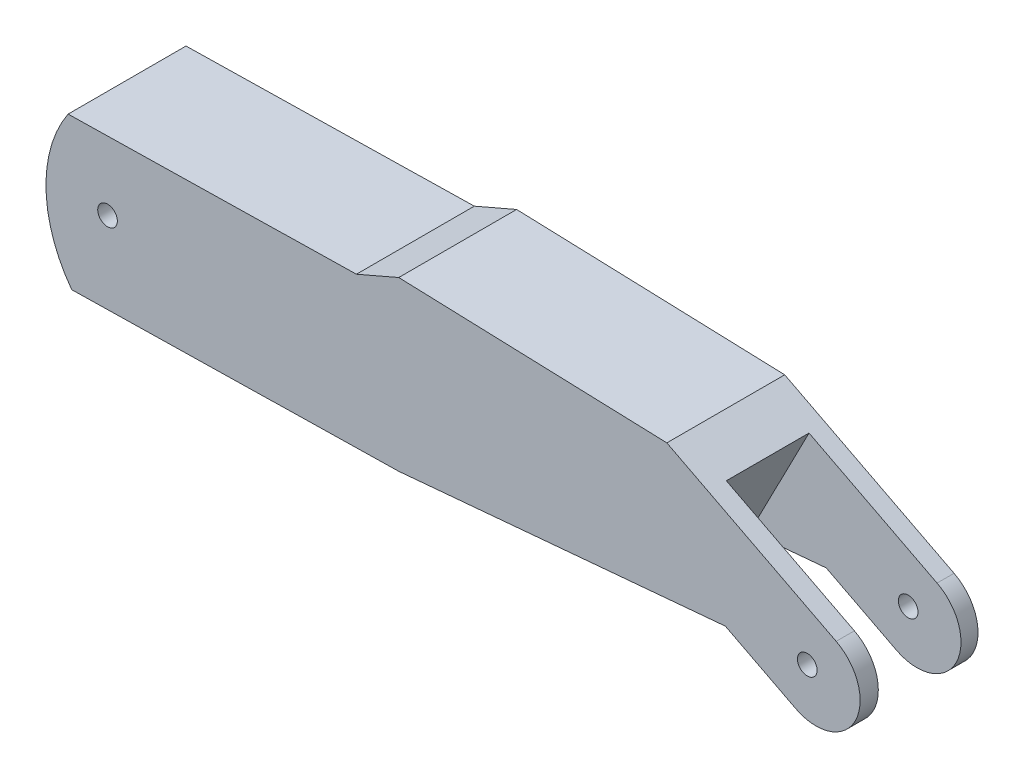
ISO-10303-21;
HEADER;
FILE_DESCRIPTION(('STEP AP214'),'2;1');
FILE_NAME('part.step','',(''),(''),'','','');
FILE_SCHEMA(('AUTOMOTIVE_DESIGN { 1 0 10303 214 1 1 1 1 }'));
ENDSEC;
DATA;
#1=APPLICATION_CONTEXT('core data for automotive mechanical design processes');
#2=APPLICATION_PROTOCOL_DEFINITION('international standard','automotive_design',2000,#1);
#3=PRODUCT_CONTEXT('',#1,'mechanical');
#4=PRODUCT('Part','Part','',(#3));
#5=PRODUCT_RELATED_PRODUCT_CATEGORY('part','',(#4));
#6=PRODUCT_DEFINITION_FORMATION('','',#4);
#7=PRODUCT_DEFINITION_CONTEXT('part definition',#1,'design');
#8=PRODUCT_DEFINITION('design','',#6,#7);
#9=PRODUCT_DEFINITION_SHAPE('','',#8);
#10=(LENGTH_UNIT() NAMED_UNIT(*) SI_UNIT(.MILLI.,.METRE.));
#11=(NAMED_UNIT(*) PLANE_ANGLE_UNIT() SI_UNIT($,.RADIAN.));
#12=(NAMED_UNIT(*) SI_UNIT($,.STERADIAN.) SOLID_ANGLE_UNIT());
#13=UNCERTAINTY_MEASURE_WITH_UNIT(LENGTH_MEASURE(1.E-05),#10,'distance_accuracy_value','');
#14=(GEOMETRIC_REPRESENTATION_CONTEXT(3) GLOBAL_UNCERTAINTY_ASSIGNED_CONTEXT((#13)) GLOBAL_UNIT_ASSIGNED_CONTEXT((#10,
#11,#12)) REPRESENTATION_CONTEXT('',''));
#15=CARTESIAN_POINT('',(0.,0.,0.));
#16=DIRECTION('',(0.,0.,1.));
#17=DIRECTION('',(1.,0.,0.));
#18=AXIS2_PLACEMENT_3D('',#15,#16,#17);
#19=CARTESIAN_POINT('',(113.217328201864,-21.3858026280319,60.));
#20=DIRECTION('',(0.457837785493839,0.889035748535512,0.));
#21=DIRECTION('',(-0.889035748535512,0.457837785493839,0.));
#22=AXIS2_PLACEMENT_3D('',#19,#20,#21);
#23=PLANE('',#22);
#24=DIRECTION('',(0.,0.,-1.));
#25=VECTOR('',#24,1.);
#26=CARTESIAN_POINT('',(149.041351205714,-39.8345448598045,60.));
#27=LINE('',#26,#25);
#28=CARTESIAN_POINT('',(149.041351205714,-39.8345448598045,8.65438853895739));
#29=VERTEX_POINT('',#28);
#30=CARTESIAN_POINT('',(149.041351205714,-39.8345448598045,0.));
#31=VERTEX_POINT('',#30);
#32=EDGE_CURVE('E202',#29,#31,#27,.T.);
#33=ORIENTED_EDGE('',*,*,#32,.F.);
#34=DIRECTION('',(-0.889035748535512,0.457837785493839,0.));
#35=VECTOR('',#34,1.);
#36=CARTESIAN_POINT('',(113.217328201864,-21.3858026280319,8.65438853895738));
#37=LINE('',#36,#35);
#38=CARTESIAN_POINT('',(113.217328201864,-21.3858026280319,8.65438853895738));
#39=VERTEX_POINT('',#38);
#40=EDGE_CURVE('E279',#29,#39,#37,.T.);
#41=ORIENTED_EDGE('',*,*,#40,.T.);
#42=DIRECTION('',(0.,0.,-1.));
#43=VECTOR('',#42,1.);
#44=CARTESIAN_POINT('',(113.217328201864,-21.3858026280319,60.));
#45=LINE('',#44,#43);
#46=CARTESIAN_POINT('',(113.217328201864,-21.3858026280319,0.));
#47=VERTEX_POINT('',#46);
#48=EDGE_CURVE('E207',#39,#47,#45,.T.);
#49=ORIENTED_EDGE('',*,*,#48,.T.);
#50=DIRECTION('',(0.889035748535511,-0.457837785493839,0.));
#51=VECTOR('',#50,1.);
#52=CARTESIAN_POINT('',(113.217328201864,-21.3858026280319,0.));
#53=LINE('',#52,#51);
#54=EDGE_CURVE('E172',#47,#31,#53,.T.);
#55=ORIENTED_EDGE('',*,*,#54,.T.);
#56=EDGE_LOOP('',(#33,#41,#49,#55));
#57=FACE_BOUND('',#56,.T.);
#58=ADVANCED_FACE('F38',(#57),#23,.F.);
#59=CARTESIAN_POINT('',(159.330643876884,-19.8546539428758,60.));
#60=DIRECTION('',(0.,0.,-1.));
#61=DIRECTION('',(-1.,0.,0.));
#62=AXIS2_PLACEMENT_3D('',#59,#60,#61);
#63=CYLINDRICAL_SURFACE('',#62,22.4736642478563);
#64=DIRECTION('',(0.,0.,-1.));
#65=VECTOR('',#64,1.);
#66=CARTESIAN_POINT('',(169.619936548055,0.125236974052926,60.));
#67=LINE('',#66,#65);
#68=CARTESIAN_POINT('',(169.619936548055,0.125236974052922,8.65438853895739));
#69=VERTEX_POINT('',#68);
#70=CARTESIAN_POINT('',(169.619936548055,0.125236974052926,0.));
#71=VERTEX_POINT('',#70);
#72=EDGE_CURVE('E197',#69,#71,#67,.T.);
#73=ORIENTED_EDGE('',*,*,#72,.F.);
#74=CARTESIAN_POINT('',(159.330643876884,-19.8546539428758,8.65438853895739));
#75=DIRECTION('',(0.,0.,-1.));
#76=DIRECTION('',(-1.,0.,0.));
#77=AXIS2_PLACEMENT_3D('',#74,#75,#76);
#78=CIRCLE('',#77,22.4736642478563);
#79=EDGE_CURVE('E275',#69,#29,#78,.T.);
#80=ORIENTED_EDGE('',*,*,#79,.T.);
#81=ORIENTED_EDGE('',*,*,#32,.T.);
#82=CARTESIAN_POINT('',(159.330643876884,-19.8546539428758,0.));
#83=DIRECTION('',(0.,0.,1.));
#84=DIRECTION('',(-1.,0.,0.));
#85=AXIS2_PLACEMENT_3D('',#82,#83,#84);
#86=CIRCLE('',#85,22.4736642478563);
#87=EDGE_CURVE('E176',#31,#71,#86,.T.);
#88=ORIENTED_EDGE('',*,*,#87,.T.);
#89=EDGE_LOOP('',(#73,#80,#81,#88));
#90=FACE_BOUND('',#89,.T.);
#91=ADVANCED_FACE('F360',(#90),#63,.T.);
#92=CARTESIAN_POINT('',(-166.376126230372,0.125236974052926,60.));
#93=DIRECTION('',(0.,0.,-1.));
#94=DIRECTION('',(-1.,0.,0.));
#95=AXIS2_PLACEMENT_3D('',#92,#93,#94);
#96=CYLINDRICAL_SURFACE('',#95,66.2010637426233);
#97=CARTESIAN_POINT('',(-166.376126230372,0.125236974052926,0.));
#98=DIRECTION('',(0.,0.,1.));
#99=DIRECTION('',(1.,0.,0.));
#100=AXIS2_PLACEMENT_3D('',#97,#98,#99);
#101=CIRCLE('',#100,66.2010637426233);
#102=CARTESIAN_POINT('',(-221.321453317817,37.0520818420964,0.));
#103=VERTEX_POINT('',#102);
#104=CARTESIAN_POINT('',(-219.455881419271,-39.4363659982916,0.));
#105=VERTEX_POINT('',#104);
#106=EDGE_CURVE('E160',#103,#105,#101,.T.);
#107=ORIENTED_EDGE('',*,*,#106,.T.);
#108=DIRECTION('',(0.,0.,-1.));
#109=VECTOR('',#108,1.);
#110=CARTESIAN_POINT('',(-219.455881419271,-39.4363659982916,60.));
#111=LINE('',#110,#109);
#112=CARTESIAN_POINT('',(-219.455881419271,-39.4363659982916,60.));
#113=VERTEX_POINT('',#112);
#114=EDGE_CURVE('E216',#113,#105,#111,.T.);
#115=ORIENTED_EDGE('',*,*,#114,.F.);
#116=CARTESIAN_POINT('',(-166.376126230372,0.125236974052926,60.));
#117=DIRECTION('',(0.,0.,1.));
#118=DIRECTION('',(1.,0.,0.));
#119=AXIS2_PLACEMENT_3D('',#116,#117,#118);
#120=CIRCLE('',#119,66.2010637426233);
#121=CARTESIAN_POINT('',(-221.321453317817,37.0520818420964,60.));
#122=VERTEX_POINT('',#121);
#123=EDGE_CURVE('E190',#122,#113,#120,.T.);
#124=ORIENTED_EDGE('',*,*,#123,.F.);
#125=DIRECTION('',(0.,0.,-1.));
#126=VECTOR('',#125,1.);
#127=CARTESIAN_POINT('',(-221.321453317817,37.0520818420964,60.));
#128=LINE('',#127,#126);
#129=EDGE_CURVE('E156',#122,#103,#128,.T.);
#130=ORIENTED_EDGE('',*,*,#129,.T.);
#131=EDGE_LOOP('',(#107,#115,#124,#130));
#132=FACE_BOUND('',#131,.T.);
#133=ADVANCED_FACE('F40',(#132),#96,.T.);
#134=CARTESIAN_POINT('',(-219.455881419271,-39.4363659982916,60.));
#135=DIRECTION('',(-0.0190643312120882,0.999818259122845,0.));
#136=DIRECTION('',(-0.999818259122845,-0.0190643312120882,0.));
#137=AXIS2_PLACEMENT_3D('',#134,#135,#136);
#138=PLANE('',#137);
#139=DIRECTION('',(0.999818259122845,0.0190643312120882,0.));
#140=VECTOR('',#139,1.);
#141=CARTESIAN_POINT('',(-219.455881419271,-39.4363659982916,0.));
#142=LINE('',#141,#140);
#143=CARTESIAN_POINT('',(-53.0220466469141,-36.2628394878018,0.));
#144=VERTEX_POINT('',#143);
#145=EDGE_CURVE('E164',#105,#144,#142,.T.);
#146=ORIENTED_EDGE('',*,*,#145,.T.);
#147=DIRECTION('',(0.,0.,-1.));
#148=VECTOR('',#147,1.);
#149=CARTESIAN_POINT('',(-53.0220466469141,-36.2628394878018,60.));
#150=LINE('',#149,#148);
#151=CARTESIAN_POINT('',(-53.0220466469141,-36.2628394878018,60.));
#152=VERTEX_POINT('',#151);
#153=EDGE_CURVE('E212',#152,#144,#150,.T.);
#154=ORIENTED_EDGE('',*,*,#153,.F.);
#155=DIRECTION('',(0.999818259122845,0.0190643312120882,0.));
#156=VECTOR('',#155,1.);
#157=CARTESIAN_POINT('',(-219.455881419271,-39.4363659982916,60.));
#158=LINE('',#157,#156);
#159=EDGE_CURVE('E110',#113,#152,#158,.T.);
#160=ORIENTED_EDGE('',*,*,#159,.F.);
#161=ORIENTED_EDGE('',*,*,#114,.T.);
#162=EDGE_LOOP('',(#146,#154,#160,#161));
#163=FACE_BOUND('',#162,.T.);
#164=ADVANCED_FACE('F321',(#163),#138,.F.);
#165=CARTESIAN_POINT('',(-53.0220466469141,-36.2628394878018,60.));
#166=DIRECTION('',(-0.0891354352755923,0.996019514958533,0.));
#167=DIRECTION('',(-0.996019514958533,-0.0891354352755923,0.));
#168=AXIS2_PLACEMENT_3D('',#165,#166,#167);
#169=PLANE('',#168);
#170=ORIENTED_EDGE('',*,*,#48,.F.);
#171=DIRECTION('',(-0.996019514958533,-0.0891354352755923,0.));
#172=VECTOR('',#171,1.);
#173=CARTESIAN_POINT('',(-53.0220466469141,-36.2628394878018,8.65438853895739));
#174=LINE('',#173,#172);
#175=CARTESIAN_POINT('',(85.2070981041051,-23.8924844896189,8.65438853895739));
#176=VERTEX_POINT('',#175);
#177=EDGE_CURVE('E165',#39,#176,#174,.T.);
#178=ORIENTED_EDGE('',*,*,#177,.T.);
#179=DIRECTION('',(0.,0.,1.));
#180=VECTOR('',#179,1.);
#181=CARTESIAN_POINT('',(85.2070981041051,-23.8924844896189,60.));
#182=LINE('',#181,#180);
#183=CARTESIAN_POINT('',(85.2070981041051,-23.8924844896189,50.7328168822099));
#184=VERTEX_POINT('',#183);
#185=EDGE_CURVE('E11',#176,#184,#182,.T.);
#186=ORIENTED_EDGE('',*,*,#185,.T.);
#187=DIRECTION('',(0.996019514958533,0.0891354352755923,0.));
#188=VECTOR('',#187,1.);
#189=CARTESIAN_POINT('',(-53.0220466469141,-36.2628394878018,50.7328168822099));
#190=LINE('',#189,#188);
#191=CARTESIAN_POINT('',(113.217328201864,-21.3858026280319,50.7328168822099));
#192=VERTEX_POINT('',#191);
#193=EDGE_CURVE('E271',#184,#192,#190,.T.);
#194=ORIENTED_EDGE('',*,*,#193,.T.);
#195=CARTESIAN_POINT('',(113.217328201864,-21.3858026280319,60.));
#196=VERTEX_POINT('',#195);
#197=EDGE_CURVE('E208',#196,#192,#45,.T.);
#198=ORIENTED_EDGE('',*,*,#197,.F.);
#199=DIRECTION('',(0.996019514958533,0.0891354352755923,0.));
#200=VECTOR('',#199,1.);
#201=CARTESIAN_POINT('',(-53.0220466469141,-36.2628394878018,60.));
#202=LINE('',#201,#200);
#203=EDGE_CURVE('E290',#152,#196,#202,.T.);
#204=ORIENTED_EDGE('',*,*,#203,.F.);
#205=ORIENTED_EDGE('',*,*,#153,.T.);
#206=DIRECTION('',(0.996019514958533,0.0891354352755923,0.));
#207=VECTOR('',#206,1.);
#208=CARTESIAN_POINT('',(-53.0220466469141,-36.2628394878018,0.));
#209=LINE('',#208,#207);
#210=EDGE_CURVE('E168',#144,#47,#209,.T.);
#211=ORIENTED_EDGE('',*,*,#210,.T.);
#212=EDGE_LOOP('',(#170,#178,#186,#194,#198,#204,#205,#211));
#213=FACE_BOUND('',#212,.T.);
#214=ADVANCED_FACE('F325',(#213),#169,.F.);
#215=ORIENTED_EDGE('',*,*,#197,.T.);
#216=DIRECTION('',(0.889035748535512,-0.457837785493839,0.));
#217=VECTOR('',#216,1.);
#218=CARTESIAN_POINT('',(113.217328201864,-21.3858026280319,50.7328168822099));
#219=LINE('',#218,#217);
#220=CARTESIAN_POINT('',(149.041351205714,-39.8345448598045,50.7328168822099));
#221=VERTEX_POINT('',#220);
#222=EDGE_CURVE('E267',#192,#221,#219,.T.);
#223=ORIENTED_EDGE('',*,*,#222,.T.);
#224=CARTESIAN_POINT('',(149.041351205714,-39.8345448598045,60.));
#225=VERTEX_POINT('',#224);
#226=EDGE_CURVE('E203',#225,#221,#27,.T.);
#227=ORIENTED_EDGE('',*,*,#226,.F.);
#228=DIRECTION('',(0.889035748535511,-0.457837785493839,0.));
#229=VECTOR('',#228,1.);
#230=CARTESIAN_POINT('',(113.217328201864,-21.3858026280319,60.));
#231=LINE('',#230,#229);
#232=EDGE_CURVE('E293',#196,#225,#231,.T.);
#233=ORIENTED_EDGE('',*,*,#232,.F.);
#234=EDGE_LOOP('',(#215,#223,#227,#233));
#235=FACE_BOUND('',#234,.T.);
#236=ADVANCED_FACE('F329',(#235),#23,.F.);
#237=ORIENTED_EDGE('',*,*,#226,.T.);
#238=CARTESIAN_POINT('',(159.330643876884,-19.8546539428758,50.7328168822099));
#239=DIRECTION('',(0.,0.,1.));
#240=DIRECTION('',(1.,0.,0.));
#241=AXIS2_PLACEMENT_3D('',#238,#239,#240);
#242=CIRCLE('',#241,22.4736642478563);
#243=CARTESIAN_POINT('',(169.619936548055,0.125236974052922,50.7328168822099));
#244=VERTEX_POINT('',#243);
#245=EDGE_CURVE('E261',#221,#244,#242,.T.);
#246=ORIENTED_EDGE('',*,*,#245,.T.);
#247=CARTESIAN_POINT('',(169.619936548055,0.125236974052926,60.));
#248=VERTEX_POINT('',#247);
#249=EDGE_CURVE('E198',#248,#244,#67,.T.);
#250=ORIENTED_EDGE('',*,*,#249,.F.);
#251=CARTESIAN_POINT('',(159.330643876884,-19.8546539428758,60.));
#252=DIRECTION('',(0.,0.,1.));
#253=DIRECTION('',(-1.,0.,0.));
#254=AXIS2_PLACEMENT_3D('',#251,#252,#253);
#255=CIRCLE('',#254,22.4736642478563);
#256=EDGE_CURVE('E296',#225,#248,#255,.T.);
#257=ORIENTED_EDGE('',*,*,#256,.F.);
#258=EDGE_LOOP('',(#237,#246,#250,#257));
#259=FACE_BOUND('',#258,.T.);
#260=ADVANCED_FACE('F304',(#259),#63,.T.);
#261=CARTESIAN_POINT('',(83.4318521036233,44.5105856880909,60.));
#262=DIRECTION('',(-0.457837785493839,-0.889035748535512,0.));
#263=DIRECTION('',(0.889035748535512,-0.457837785493839,0.));
#264=AXIS2_PLACEMENT_3D('',#261,#262,#263);
#265=PLANE('',#264);
#266=DIRECTION('',(0.,0.,1.));
#267=VECTOR('',#266,1.);
#268=CARTESIAN_POINT('',(104.450943764605,33.6861228979185,50.7328168822099));
#269=LINE('',#268,#267);
#270=CARTESIAN_POINT('',(104.450943764605,33.6861228979185,8.65438853895739));
#271=VERTEX_POINT('',#270);
#272=CARTESIAN_POINT('',(104.450943764605,33.6861228979185,50.7328168822099));
#273=VERTEX_POINT('',#272);
#274=EDGE_CURVE('E56',#271,#273,#269,.T.);
#275=ORIENTED_EDGE('',*,*,#274,.F.);
#276=DIRECTION('',(0.889035748535512,-0.457837785493839,0.));
#277=VECTOR('',#276,1.);
#278=CARTESIAN_POINT('',(83.4318521036233,44.5105856880909,8.65438853895738));
#279=LINE('',#278,#277);
#280=EDGE_CURVE('E48',#271,#69,#279,.T.);
#281=ORIENTED_EDGE('',*,*,#280,.T.);
#282=ORIENTED_EDGE('',*,*,#72,.T.);
#283=DIRECTION('',(-0.889035748535512,0.457837785493839,0.));
#284=VECTOR('',#283,1.);
#285=CARTESIAN_POINT('',(83.4318521036233,44.5105856880909,0.));
#286=LINE('',#285,#284);
#287=CARTESIAN_POINT('',(83.4318521036233,44.5105856880909,0.));
#288=VERTEX_POINT('',#287);
#289=EDGE_CURVE('E180',#71,#288,#286,.T.);
#290=ORIENTED_EDGE('',*,*,#289,.T.);
#291=DIRECTION('',(0.,0.,-1.));
#292=VECTOR('',#291,1.);
#293=CARTESIAN_POINT('',(83.4318521036233,44.5105856880909,60.));
#294=LINE('',#293,#292);
#295=CARTESIAN_POINT('',(83.4318521036233,44.5105856880909,60.));
#296=VERTEX_POINT('',#295);
#297=EDGE_CURVE('E149',#296,#288,#294,.T.);
#298=ORIENTED_EDGE('',*,*,#297,.F.);
#299=DIRECTION('',(-0.889035748535512,0.457837785493839,0.));
#300=VECTOR('',#299,1.);
#301=CARTESIAN_POINT('',(83.4318521036233,44.5105856880909,60.));
#302=LINE('',#301,#300);
#303=EDGE_CURVE('E135',#248,#296,#302,.T.);
#304=ORIENTED_EDGE('',*,*,#303,.F.);
#305=ORIENTED_EDGE('',*,*,#249,.T.);
#306=DIRECTION('',(0.889035748535512,-0.457837785493839,0.));
#307=VECTOR('',#306,1.);
#308=CARTESIAN_POINT('',(104.450943764605,33.6861228979185,50.7328168822099));
#309=LINE('',#308,#307);
#310=EDGE_CURVE('E229',#273,#244,#309,.T.);
#311=ORIENTED_EDGE('',*,*,#310,.F.);
#312=EDGE_LOOP('',(#275,#281,#282,#290,#298,#304,#305,#311));
#313=FACE_BOUND('',#312,.T.);
#314=ADVANCED_FACE('F309',(#313),#265,.F.);
#315=CARTESIAN_POINT('',(-53.0220466469141,49.1707316862662,60.));
#316=DIRECTION('',(-0.03413189909632,-0.999417336983944,0.));
#317=DIRECTION('',(0.999417336983944,-0.03413189909632,0.));
#318=AXIS2_PLACEMENT_3D('',#315,#316,#317);
#319=PLANE('',#318);
#320=DIRECTION('',(-0.999417336983944,0.03413189909632,0.));
#321=VECTOR('',#320,1.);
#322=CARTESIAN_POINT('',(-53.0220466469141,49.1707316862662,0.));
#323=LINE('',#322,#321);
#324=CARTESIAN_POINT('',(-53.0220466469141,49.1707316862662,0.));
#325=VERTEX_POINT('',#324);
#326=EDGE_CURVE('E145',#288,#325,#323,.T.);
#327=ORIENTED_EDGE('',*,*,#326,.T.);
#328=DIRECTION('',(0.,0.,-1.));
#329=VECTOR('',#328,1.);
#330=CARTESIAN_POINT('',(-53.0220466469141,49.1707316862662,60.));
#331=LINE('',#330,#329);
#332=CARTESIAN_POINT('',(-53.0220466469141,49.1707316862662,60.));
#333=VERTEX_POINT('',#332);
#334=EDGE_CURVE('E142',#333,#325,#331,.T.);
#335=ORIENTED_EDGE('',*,*,#334,.F.);
#336=DIRECTION('',(-0.999417336983944,0.03413189909632,0.));
#337=VECTOR('',#336,1.);
#338=CARTESIAN_POINT('',(-53.0220466469141,49.1707316862662,60.));
#339=LINE('',#338,#337);
#340=EDGE_CURVE('E128',#296,#333,#339,.T.);
#341=ORIENTED_EDGE('',*,*,#340,.F.);
#342=ORIENTED_EDGE('',*,*,#297,.T.);
#343=EDGE_LOOP('',(#327,#335,#341,#342));
#344=FACE_BOUND('',#343,.T.);
#345=ADVANCED_FACE('F143',(#344),#319,.F.);
#346=CARTESIAN_POINT('',(-74.5631306321944,39.8504396899155,60.));
#347=DIRECTION('',(0.397098818433817,-0.917775859564015,0.));
#348=DIRECTION('',(0.917775859564015,0.397098818433817,0.));
#349=AXIS2_PLACEMENT_3D('',#346,#347,#348);
#350=PLANE('',#349);
#351=DIRECTION('',(-0.917775859564015,-0.397098818433817,0.));
#352=VECTOR('',#351,1.);
#353=CARTESIAN_POINT('',(-74.5631306321944,39.8504396899155,0.));
#354=LINE('',#353,#352);
#355=CARTESIAN_POINT('',(-74.5631306321944,39.8504396899155,0.));
#356=VERTEX_POINT('',#355);
#357=EDGE_CURVE('E185',#325,#356,#354,.T.);
#358=ORIENTED_EDGE('',*,*,#357,.T.);
#359=DIRECTION('',(0.,0.,-1.));
#360=VECTOR('',#359,1.);
#361=CARTESIAN_POINT('',(-74.5631306321944,39.8504396899155,60.));
#362=LINE('',#361,#360);
#363=CARTESIAN_POINT('',(-74.5631306321944,39.8504396899155,60.));
#364=VERTEX_POINT('',#363);
#365=EDGE_CURVE('E150',#364,#356,#362,.T.);
#366=ORIENTED_EDGE('',*,*,#365,.F.);
#367=DIRECTION('',(-0.917775859564015,-0.397098818433817,0.));
#368=VECTOR('',#367,1.);
#369=CARTESIAN_POINT('',(-74.5631306321944,39.8504396899155,60.));
#370=LINE('',#369,#368);
#371=EDGE_CURVE('E132',#333,#364,#370,.T.);
#372=ORIENTED_EDGE('',*,*,#371,.F.);
#373=ORIENTED_EDGE('',*,*,#334,.T.);
#374=EDGE_LOOP('',(#358,#366,#372,#373));
#375=FACE_BOUND('',#374,.T.);
#376=ADVANCED_FACE('F152',(#375),#350,.F.);
#377=CARTESIAN_POINT('',(-221.321453317817,37.0520818420964,60.));
#378=DIRECTION('',(0.0190643312120882,-0.999818259122845,0.));
#379=DIRECTION('',(0.999818259122845,0.0190643312120882,0.));
#380=AXIS2_PLACEMENT_3D('',#377,#378,#379);
#381=PLANE('',#380);
#382=DIRECTION('',(-0.999818259122845,-0.0190643312120882,0.));
#383=VECTOR('',#382,1.);
#384=CARTESIAN_POINT('',(-221.321453317817,37.0520818420964,0.));
#385=LINE('',#384,#383);
#386=EDGE_CURVE('E101',#356,#103,#385,.T.);
#387=ORIENTED_EDGE('',*,*,#386,.T.);
#388=ORIENTED_EDGE('',*,*,#129,.F.);
#389=DIRECTION('',(-0.999818259122845,-0.0190643312120882,0.));
#390=VECTOR('',#389,1.);
#391=CARTESIAN_POINT('',(-221.321453317817,37.0520818420964,60.));
#392=LINE('',#391,#390);
#393=EDGE_CURVE('E65',#364,#122,#392,.T.);
#394=ORIENTED_EDGE('',*,*,#393,.F.);
#395=ORIENTED_EDGE('',*,*,#365,.T.);
#396=EDGE_LOOP('',(#387,#388,#394,#395));
#397=FACE_BOUND('',#396,.T.);
#398=ADVANCED_FACE('F315',(#397),#381,.F.);
#399=CARTESIAN_POINT('',(-166.376126230372,0.125236974052926,60.));
#400=DIRECTION('',(0.,0.,1.));
#401=DIRECTION('',(1.,0.,0.));
#402=AXIS2_PLACEMENT_3D('',#399,#400,#401);
#403=PLANE('',#402);
#404=CARTESIAN_POINT('',(154.912488726651,-17.5137342371907,60.));
#405=DIRECTION('',(0.,0.,1.));
#406=DIRECTION('',(1.,0.,0.));
#407=AXIS2_PLACEMENT_3D('',#404,#405,#406);
#408=CIRCLE('',#407,4.99999999999999);
#409=CARTESIAN_POINT('',(159.912488726651,-17.5137342371907,60.));
#410=VERTEX_POINT('',#409);
#411=EDGE_CURVE('E509',#410,#410,#408,.T.);
#412=ORIENTED_EDGE('',*,*,#411,.F.);
#413=EDGE_LOOP('',(#412));
#414=FACE_BOUND('',#413,.T.);
#415=CARTESIAN_POINT('',(-201.233979759626,2.42874361536443,60.));
#416=DIRECTION('',(0.,0.,1.));
#417=DIRECTION('',(1.,0.,0.));
#418=AXIS2_PLACEMENT_3D('',#415,#416,#417);
#419=CIRCLE('',#418,4.99999999999999);
#420=CARTESIAN_POINT('',(-196.233979759626,2.42874361536443,60.));
#421=VERTEX_POINT('',#420);
#422=EDGE_CURVE('E224',#421,#421,#419,.T.);
#423=ORIENTED_EDGE('',*,*,#422,.F.);
#424=EDGE_LOOP('',(#423));
#425=FACE_BOUND('',#424,.T.);
#426=ORIENTED_EDGE('',*,*,#123,.T.);
#427=ORIENTED_EDGE('',*,*,#159,.T.);
#428=ORIENTED_EDGE('',*,*,#203,.T.);
#429=ORIENTED_EDGE('',*,*,#232,.T.);
#430=ORIENTED_EDGE('',*,*,#256,.T.);
#431=ORIENTED_EDGE('',*,*,#303,.T.);
#432=ORIENTED_EDGE('',*,*,#340,.T.);
#433=ORIENTED_EDGE('',*,*,#371,.T.);
#434=ORIENTED_EDGE('',*,*,#393,.T.);
#435=EDGE_LOOP('',(#426,#427,#428,#429,#430,#431,#432,#433,#434));
#436=FACE_BOUND('',#435,.T.);
#437=ADVANCED_FACE('F130',(#414,#425,#436),#403,.T.);
#438=CARTESIAN_POINT('',(-166.376126230372,0.125236974052926,0.));
#439=DIRECTION('',(0.,0.,1.));
#440=DIRECTION('',(1.,0.,0.));
#441=AXIS2_PLACEMENT_3D('',#438,#439,#440);
#442=PLANE('',#441);
#443=CARTESIAN_POINT('',(154.912488726651,-17.5137342371907,0.));
#444=DIRECTION('',(0.,0.,1.));
#445=DIRECTION('',(1.,0.,0.));
#446=AXIS2_PLACEMENT_3D('',#443,#444,#445);
#447=CIRCLE('',#446,4.99999999999999);
#448=CARTESIAN_POINT('',(159.912488726651,-17.5137342371907,0.));
#449=VERTEX_POINT('',#448);
#450=EDGE_CURVE('E232',#449,#449,#447,.T.);
#451=ORIENTED_EDGE('',*,*,#450,.T.);
#452=EDGE_LOOP('',(#451));
#453=FACE_BOUND('',#452,.T.);
#454=CARTESIAN_POINT('',(-201.233979759626,2.42874361536443,0.));
#455=DIRECTION('',(0.,0.,1.));
#456=DIRECTION('',(1.,0.,0.));
#457=AXIS2_PLACEMENT_3D('',#454,#455,#456);
#458=CIRCLE('',#457,4.99999999999999);
#459=CARTESIAN_POINT('',(-196.233979759626,2.42874361536443,0.));
#460=VERTEX_POINT('',#459);
#461=EDGE_CURVE('E221',#460,#460,#458,.T.);
#462=ORIENTED_EDGE('',*,*,#461,.T.);
#463=EDGE_LOOP('',(#462));
#464=FACE_BOUND('',#463,.T.);
#465=ORIENTED_EDGE('',*,*,#106,.F.);
#466=ORIENTED_EDGE('',*,*,#386,.F.);
#467=ORIENTED_EDGE('',*,*,#357,.F.);
#468=ORIENTED_EDGE('',*,*,#326,.F.);
#469=ORIENTED_EDGE('',*,*,#289,.F.);
#470=ORIENTED_EDGE('',*,*,#87,.F.);
#471=ORIENTED_EDGE('',*,*,#54,.F.);
#472=ORIENTED_EDGE('',*,*,#210,.F.);
#473=ORIENTED_EDGE('',*,*,#145,.F.);
#474=EDGE_LOOP('',(#465,#466,#467,#468,#469,#470,#471,#472,#473));
#475=FACE_BOUND('',#474,.T.);
#476=ADVANCED_FACE('F313',(#453,#464,#475),#442,.F.);
#477=CARTESIAN_POINT('',(8.13566586021791,15.7979485683384,0.));
#478=DIRECTION('',(-0.457837785493839,-0.889035748535512,0.));
#479=DIRECTION('',(0.889035748535512,-0.457837785493839,0.));
#480=AXIS2_PLACEMENT_3D('',#477,#478,#479);
#481=PLANE('',#480);
#482=DIRECTION('',(-0.889035748535512,0.457837785493839,0.));
#483=VECTOR('',#482,1.);
#484=CARTESIAN_POINT('',(76.9806766349742,-19.6560220142122,8.65438853895739));
#485=LINE('',#484,#483);
#486=CARTESIAN_POINT('',(76.9806766349742,-19.6560220142122,8.65438853895739));
#487=VERTEX_POINT('',#486);
#488=EDGE_CURVE('E250',#176,#487,#485,.T.);
#489=ORIENTED_EDGE('',*,*,#488,.T.);
#490=DIRECTION('',(0.,0.,1.));
#491=VECTOR('',#490,1.);
#492=CARTESIAN_POINT('',(76.9806766349742,-19.6560220142122,50.7328168822099));
#493=LINE('',#492,#491);
#494=CARTESIAN_POINT('',(76.9806766349742,-19.6560220142122,50.7328168822099));
#495=VERTEX_POINT('',#494);
#496=EDGE_CURVE('E242',#487,#495,#493,.T.);
#497=ORIENTED_EDGE('',*,*,#496,.T.);
#498=DIRECTION('',(0.889035748535512,-0.457837785493839,0.));
#499=VECTOR('',#498,1.);
#500=CARTESIAN_POINT('',(76.9806766349742,-19.6560220142122,50.7328168822099));
#501=LINE('',#500,#499);
#502=EDGE_CURVE('E246',#495,#184,#501,.T.);
#503=ORIENTED_EDGE('',*,*,#502,.T.);
#504=ORIENTED_EDGE('',*,*,#185,.F.);
#505=EDGE_LOOP('',(#489,#497,#503,#504));
#506=FACE_BOUND('',#505,.T.);
#507=ADVANCED_FACE('F372',(#506),#481,.F.);
#508=CARTESIAN_POINT('',(76.9806766349742,-19.6560220142122,8.65438853895739));
#509=DIRECTION('',(0.,0.,-1.));
#510=DIRECTION('',(-1.,0.,0.));
#511=AXIS2_PLACEMENT_3D('',#508,#509,#510);
#512=PLANE('',#511);
#513=CARTESIAN_POINT('',(154.912488726651,-17.5137342371907,8.65438853895739));
#514=DIRECTION('',(0.,0.,-1.));
#515=DIRECTION('',(-1.,0.,0.));
#516=AXIS2_PLACEMENT_3D('',#513,#514,#515);
#517=CIRCLE('',#516,4.99999999999999);
#518=CARTESIAN_POINT('',(149.912488726651,-17.5137342371907,8.65438853895739));
#519=VERTEX_POINT('',#518);
#520=EDGE_CURVE('E238',#519,#519,#517,.T.);
#521=ORIENTED_EDGE('',*,*,#520,.T.);
#522=EDGE_LOOP('',(#521));
#523=FACE_BOUND('',#522,.T.);
#524=ORIENTED_EDGE('',*,*,#40,.F.);
#525=ORIENTED_EDGE('',*,*,#79,.F.);
#526=ORIENTED_EDGE('',*,*,#280,.F.);
#527=DIRECTION('',(0.457837785493839,0.889035748535512,0.));
#528=VECTOR('',#527,1.);
#529=CARTESIAN_POINT('',(76.9806766349742,-19.6560220142122,8.65438853895739));
#530=LINE('',#529,#528);
#531=EDGE_CURVE('E258',#487,#271,#530,.T.);
#532=ORIENTED_EDGE('',*,*,#531,.F.);
#533=ORIENTED_EDGE('',*,*,#488,.F.);
#534=ORIENTED_EDGE('',*,*,#177,.F.);
#535=EDGE_LOOP('',(#524,#525,#526,#532,#533,#534));
#536=FACE_BOUND('',#535,.T.);
#537=ADVANCED_FACE('F349',(#523,#536),#512,.F.);
#538=CARTESIAN_POINT('',(76.9806766349742,-19.6560220142122,50.7328168822099));
#539=DIRECTION('',(0.,0.,1.));
#540=DIRECTION('',(1.,0.,0.));
#541=AXIS2_PLACEMENT_3D('',#538,#539,#540);
#542=PLANE('',#541);
#543=CARTESIAN_POINT('',(154.912488726651,-17.5137342371907,50.7328168822099));
#544=DIRECTION('',(0.,0.,1.));
#545=DIRECTION('',(1.,0.,0.));
#546=AXIS2_PLACEMENT_3D('',#543,#544,#545);
#547=CIRCLE('',#546,4.99999999999999);
#548=CARTESIAN_POINT('',(159.912488726651,-17.5137342371907,50.7328168822099));
#549=VERTEX_POINT('',#548);
#550=EDGE_CURVE('E42',#549,#549,#547,.T.);
#551=ORIENTED_EDGE('',*,*,#550,.T.);
#552=EDGE_LOOP('',(#551));
#553=FACE_BOUND('',#552,.T.);
#554=ORIENTED_EDGE('',*,*,#502,.F.);
#555=DIRECTION('',(0.457837785493839,0.889035748535512,0.));
#556=VECTOR('',#555,1.);
#557=CARTESIAN_POINT('',(76.9806766349742,-19.6560220142122,50.7328168822099));
#558=LINE('',#557,#556);
#559=EDGE_CURVE('E253',#495,#273,#558,.T.);
#560=ORIENTED_EDGE('',*,*,#559,.T.);
#561=ORIENTED_EDGE('',*,*,#310,.T.);
#562=ORIENTED_EDGE('',*,*,#245,.F.);
#563=ORIENTED_EDGE('',*,*,#222,.F.);
#564=ORIENTED_EDGE('',*,*,#193,.F.);
#565=EDGE_LOOP('',(#554,#560,#561,#562,#563,#564));
#566=FACE_BOUND('',#565,.T.);
#567=ADVANCED_FACE('F368',(#553,#566),#542,.F.);
#568=CARTESIAN_POINT('',(76.9806766349742,-19.6560220142122,50.7328168822099));
#569=DIRECTION('',(-0.889035748535512,0.457837785493839,0.));
#570=DIRECTION('',(-0.457837785493839,-0.889035748535512,0.));
#571=AXIS2_PLACEMENT_3D('',#568,#569,#570);
#572=PLANE('',#571);
#573=ORIENTED_EDGE('',*,*,#274,.T.);
#574=ORIENTED_EDGE('',*,*,#559,.F.);
#575=ORIENTED_EDGE('',*,*,#496,.F.);
#576=ORIENTED_EDGE('',*,*,#531,.T.);
#577=EDGE_LOOP('',(#573,#574,#575,#576));
#578=FACE_BOUND('',#577,.T.);
#579=ADVANCED_FACE('F366',(#578),#572,.F.);
#580=CARTESIAN_POINT('',(-201.233979759626,2.42874361536443,-20.));
#581=DIRECTION('',(0.,0.,1.));
#582=DIRECTION('',(1.,0.,0.));
#583=AXIS2_PLACEMENT_3D('',#580,#581,#582);
#584=CYLINDRICAL_SURFACE('',#583,4.99999999999999);
#585=ORIENTED_EDGE('',*,*,#422,.T.);
#586=EDGE_LOOP('',(#585));
#587=FACE_BOUND('',#586,.T.);
#588=ORIENTED_EDGE('',*,*,#461,.F.);
#589=EDGE_LOOP('',(#588));
#590=FACE_BOUND('',#589,.T.);
#591=ADVANCED_FACE('F453',(#587,#590),#584,.F.);
#592=CARTESIAN_POINT('',(154.912488726651,-17.5137342371907,-20.));
#593=DIRECTION('',(0.,0.,1.));
#594=DIRECTION('',(1.,0.,0.));
#595=AXIS2_PLACEMENT_3D('',#592,#593,#594);
#596=CYLINDRICAL_SURFACE('',#595,4.99999999999999);
#597=ORIENTED_EDGE('',*,*,#411,.T.);
#598=EDGE_LOOP('',(#597));
#599=FACE_BOUND('',#598,.T.);
#600=ORIENTED_EDGE('',*,*,#550,.F.);
#601=EDGE_LOOP('',(#600));
#602=FACE_BOUND('',#601,.T.);
#603=ADVANCED_FACE('F464',(#599,#602),#596,.F.);
#604=ORIENTED_EDGE('',*,*,#520,.F.);
#605=EDGE_LOOP('',(#604));
#606=FACE_BOUND('',#605,.T.);
#607=ORIENTED_EDGE('',*,*,#450,.F.);
#608=EDGE_LOOP('',(#607));
#609=FACE_BOUND('',#608,.T.);
#610=ADVANCED_FACE('F489',(#606,#609),#596,.F.);
#611=CLOSED_SHELL('',(#58,#91,#133,#164,#214,#236,#260,#314,#345,#376,#398,#437,#476,#507,#537,
#567,#579,#591,#603,#610));
#612=MANIFOLD_SOLID_BREP('B2',#611);
#613=ADVANCED_BREP_SHAPE_REPRESENTATION('',(#18,#612),#14);
#614=SHAPE_DEFINITION_REPRESENTATION(#9,#613);
ENDSEC;
END-ISO-10303-21;
